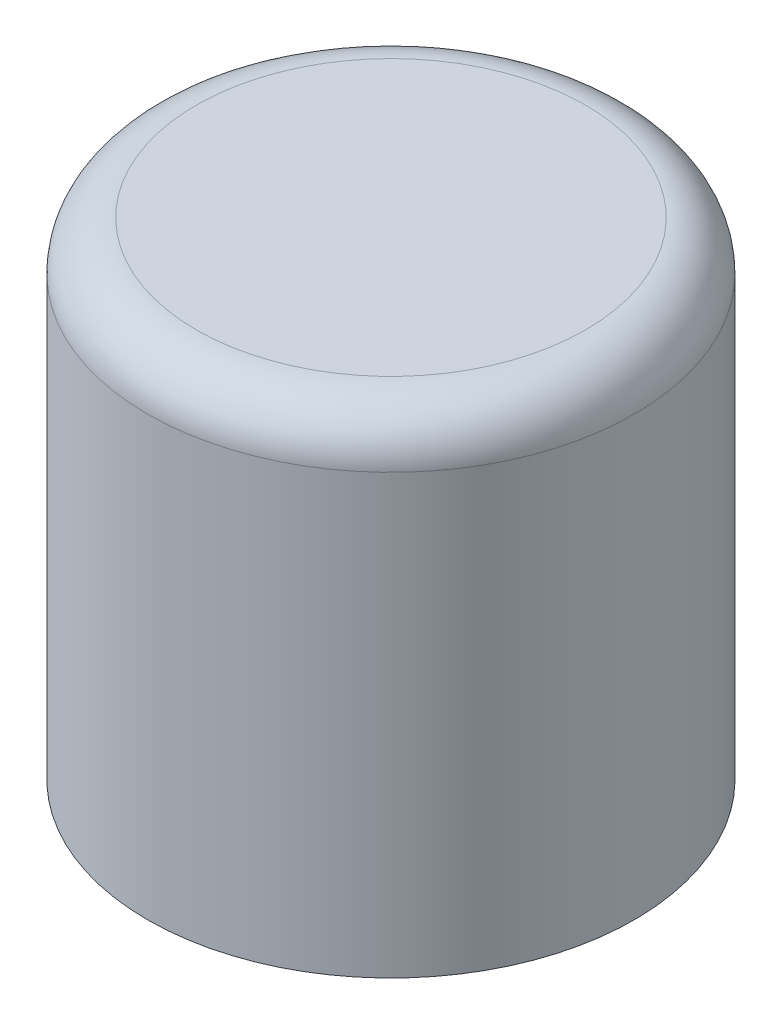
ISO-10303-21;
HEADER;
FILE_DESCRIPTION(('STEP AP214'),'2;1');
FILE_NAME('part.step','',(''),(''),'','','');
FILE_SCHEMA(('AUTOMOTIVE_DESIGN { 1 0 10303 214 1 1 1 1 }'));
ENDSEC;
DATA;
#1=APPLICATION_CONTEXT('core data for automotive mechanical design processes');
#2=APPLICATION_PROTOCOL_DEFINITION('international standard','automotive_design',2000,#1);
#3=PRODUCT_CONTEXT('',#1,'mechanical');
#4=PRODUCT('Part','Part','',(#3));
#5=PRODUCT_RELATED_PRODUCT_CATEGORY('part','',(#4));
#6=PRODUCT_DEFINITION_FORMATION('','',#4);
#7=PRODUCT_DEFINITION_CONTEXT('part definition',#1,'design');
#8=PRODUCT_DEFINITION('design','',#6,#7);
#9=PRODUCT_DEFINITION_SHAPE('','',#8);
#10=(LENGTH_UNIT() NAMED_UNIT(*) SI_UNIT(.MILLI.,.METRE.));
#11=(NAMED_UNIT(*) PLANE_ANGLE_UNIT() SI_UNIT($,.RADIAN.));
#12=(NAMED_UNIT(*) SI_UNIT($,.STERADIAN.) SOLID_ANGLE_UNIT());
#13=UNCERTAINTY_MEASURE_WITH_UNIT(LENGTH_MEASURE(1.E-05),#10,'distance_accuracy_value','');
#14=(GEOMETRIC_REPRESENTATION_CONTEXT(3) GLOBAL_UNCERTAINTY_ASSIGNED_CONTEXT((#13)) GLOBAL_UNIT_ASSIGNED_CONTEXT((#10,
#11,#12)) REPRESENTATION_CONTEXT('',''));
#15=CARTESIAN_POINT('',(0.,0.,0.));
#16=DIRECTION('',(0.,0.,1.));
#17=DIRECTION('',(1.,0.,0.));
#18=AXIS2_PLACEMENT_3D('',#15,#16,#17);
#19=CARTESIAN_POINT('',(0.,20.,0.));
#20=DIRECTION('',(0.,1.,0.));
#21=DIRECTION('',(0.,0.,1.));
#22=AXIS2_PLACEMENT_3D('',#19,#20,#21);
#23=PLANE('',#22);
#24=CARTESIAN_POINT('',(0.,19.9999999999988,0.));
#25=DIRECTION('',(0.,1.,0.));
#26=DIRECTION('',(0.,0.,1.));
#27=AXIS2_PLACEMENT_3D('',#24,#25,#26);
#28=CIRCLE('',#27,7.99999780145659);
#29=CARTESIAN_POINT('',(7.99988486148704,19.9999999999991,0.0426115231751133));
#30=VERTEX_POINT('',#29);
#31=CARTESIAN_POINT('',(7.99999997906,20.,0.));
#32=VERTEX_POINT('',#31);
#33=EDGE_CURVE('E32',#30,#32,#28,.F.);
#34=ORIENTED_EDGE('',*,*,#33,.F.);
#35=DIRECTION('',(0.00271448682693784,0.,-0.999996315773846));
#36=VECTOR('',#35,1.);
#37=CARTESIAN_POINT('',(7.99988431022392,20.,0.0426115200790233));
#38=LINE('',#37,#36);
#39=EDGE_CURVE('E20',#30,#32,#38,.T.);
#40=ORIENTED_EDGE('',*,*,#39,.T.);
#41=EDGE_LOOP('',(#34,#40));
#42=FACE_BOUND('',#41,.T.);
#43=ADVANCED_FACE('F16',(#42),#23,.T.);
#44=CARTESIAN_POINT('',(0.,0.,0.));
#45=DIRECTION('',(0.,1.,0.));
#46=DIRECTION('',(0.,0.,1.));
#47=AXIS2_PLACEMENT_3D('',#44,#45,#46);
#48=PLANE('',#47);
#49=CARTESIAN_POINT('',(0.,0.,0.));
#50=DIRECTION('',(0.,1.,0.));
#51=DIRECTION('',(0.,0.,1.));
#52=AXIS2_PLACEMENT_3D('',#49,#50,#51);
#53=CIRCLE('',#52,10.);
#54=CARTESIAN_POINT('',(0.,0.,10.));
#55=VERTEX_POINT('',#54);
#56=EDGE_CURVE('E26',#55,#55,#53,.T.);
#57=ORIENTED_EDGE('',*,*,#56,.F.);
#58=EDGE_LOOP('',(#57));
#59=FACE_BOUND('',#58,.T.);
#60=ADVANCED_FACE('F43',(#59),#48,.F.);
#61=CARTESIAN_POINT('',(0.,18.,0.));
#62=DIRECTION('',(0.,1.,0.));
#63=DIRECTION('',(0.,0.,1.));
#64=AXIS2_PLACEMENT_3D('',#61,#62,#63);
#65=TOROIDAL_SURFACE('',#64,8.00000000000001,2.);
#66=ORIENTED_EDGE('',*,*,#39,.F.);
#67=ORIENTED_EDGE('',*,*,#33,.T.);
#68=EDGE_LOOP('',(#66,#67));
#69=FACE_BOUND('',#68,.T.);
#70=CARTESIAN_POINT('',(0.,18.,0.));
#71=DIRECTION('',(0.,1.,0.));
#72=DIRECTION('',(0.,0.,1.));
#73=AXIS2_PLACEMENT_3D('',#70,#71,#72);
#74=CIRCLE('',#73,10.);
#75=CARTESIAN_POINT('',(0.,18.,10.));
#76=VERTEX_POINT('',#75);
#77=EDGE_CURVE('E11',#76,#76,#74,.F.);
#78=ORIENTED_EDGE('',*,*,#77,.F.);
#79=EDGE_LOOP('',(#78));
#80=FACE_BOUND('',#79,.T.);
#81=ADVANCED_FACE('F18',(#69,#80),#65,.T.);
#82=CARTESIAN_POINT('',(0.,0.,0.));
#83=DIRECTION('',(0.,1.,0.));
#84=DIRECTION('',(0.,0.,1.));
#85=AXIS2_PLACEMENT_3D('',#82,#83,#84);
#86=CYLINDRICAL_SURFACE('',#85,10.);
#87=ORIENTED_EDGE('',*,*,#56,.T.);
#88=EDGE_LOOP('',(#87));
#89=FACE_BOUND('',#88,.T.);
#90=ORIENTED_EDGE('',*,*,#77,.T.);
#91=EDGE_LOOP('',(#90));
#92=FACE_BOUND('',#91,.T.);
#93=ADVANCED_FACE('F40',(#89,#92),#86,.T.);
#94=CLOSED_SHELL('',(#43,#60,#81,#93));
#95=MANIFOLD_SOLID_BREP('B1',#94);
#96=ADVANCED_BREP_SHAPE_REPRESENTATION('',(#18,#95),#14);
#97=SHAPE_DEFINITION_REPRESENTATION(#9,#96);
ENDSEC;
END-ISO-10303-21;
